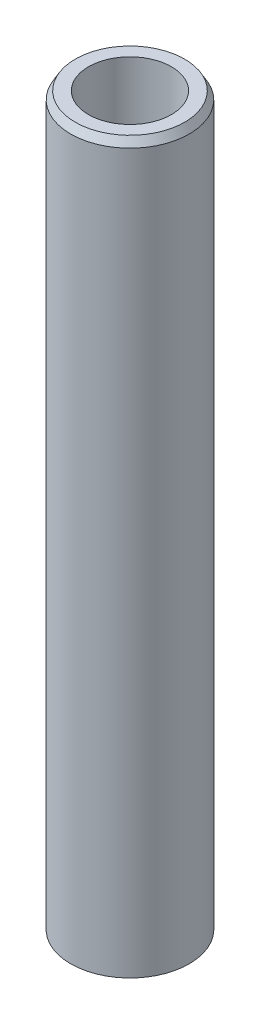
ISO-10303-21;
HEADER;
FILE_DESCRIPTION(('STEP AP214'),'2;1');
FILE_NAME('part.step','',(''),(''),'','','');
FILE_SCHEMA(('AUTOMOTIVE_DESIGN { 1 0 10303 214 1 1 1 1 }'));
ENDSEC;
DATA;
#1=APPLICATION_CONTEXT('core data for automotive mechanical design processes');
#2=APPLICATION_PROTOCOL_DEFINITION('international standard','automotive_design',2000,#1);
#3=PRODUCT_CONTEXT('',#1,'mechanical');
#4=PRODUCT('Part','Part','',(#3));
#5=PRODUCT_RELATED_PRODUCT_CATEGORY('part','',(#4));
#6=PRODUCT_DEFINITION_FORMATION('','',#4);
#7=PRODUCT_DEFINITION_CONTEXT('part definition',#1,'design');
#8=PRODUCT_DEFINITION('design','',#6,#7);
#9=PRODUCT_DEFINITION_SHAPE('','',#8);
#10=(LENGTH_UNIT() NAMED_UNIT(*) SI_UNIT(.MILLI.,.METRE.));
#11=(NAMED_UNIT(*) PLANE_ANGLE_UNIT() SI_UNIT($,.RADIAN.));
#12=(NAMED_UNIT(*) SI_UNIT($,.STERADIAN.) SOLID_ANGLE_UNIT());
#13=UNCERTAINTY_MEASURE_WITH_UNIT(LENGTH_MEASURE(1.E-05),#10,'distance_accuracy_value','');
#14=(GEOMETRIC_REPRESENTATION_CONTEXT(3) GLOBAL_UNCERTAINTY_ASSIGNED_CONTEXT((#13)) GLOBAL_UNIT_ASSIGNED_CONTEXT((#10,
#11,#12)) REPRESENTATION_CONTEXT('',''));
#15=CARTESIAN_POINT('',(0.,0.,0.));
#16=DIRECTION('',(0.,0.,1.));
#17=DIRECTION('',(1.,0.,0.));
#18=AXIS2_PLACEMENT_3D('',#15,#16,#17);
#19=CARTESIAN_POINT('',(0.,462.536337045634,0.));
#20=DIRECTION('',(0.,-1.,0.));
#21=DIRECTION('',(0.,0.,-1.));
#22=AXIS2_PLACEMENT_3D('',#19,#20,#21);
#23=CYLINDRICAL_SURFACE('',#22,37.5);
#24=CARTESIAN_POINT('',(0.,457.516317716799,0.));
#25=DIRECTION('',(0.,1.,0.));
#26=DIRECTION('',(0.,0.,1.));
#27=AXIS2_PLACEMENT_3D('',#24,#25,#26);
#28=CIRCLE('',#27,37.5);
#29=CARTESIAN_POINT('',(0.,457.516317716799,37.5));
#30=VERTEX_POINT('',#29);
#31=EDGE_CURVE('E50',#30,#30,#28,.F.);
#32=ORIENTED_EDGE('',*,*,#31,.T.);
#33=EDGE_LOOP('',(#32));
#34=FACE_BOUND('',#33,.T.);
#35=CARTESIAN_POINT('',(0.,2.89830951084002,0.));
#36=DIRECTION('',(0.,1.,0.));
#37=DIRECTION('',(0.,0.,1.));
#38=AXIS2_PLACEMENT_3D('',#35,#36,#37);
#39=CIRCLE('',#38,37.5);
#40=CARTESIAN_POINT('',(0.,2.89830951084002,37.5));
#41=VERTEX_POINT('',#40);
#42=EDGE_CURVE('E51',#41,#41,#39,.T.);
#43=ORIENTED_EDGE('',*,*,#42,.T.);
#44=EDGE_LOOP('',(#43));
#45=FACE_BOUND('',#44,.T.);
#46=ADVANCED_FACE('F39',(#34,#45),#23,.T.);
#47=CARTESIAN_POINT('',(0.,462.536337045634,0.));
#48=DIRECTION('',(0.,1.,0.));
#49=DIRECTION('',(0.,0.,1.));
#50=AXIS2_PLACEMENT_3D('',#47,#48,#49);
#51=PLANE('',#50);
#52=CARTESIAN_POINT('',(0.,462.536337045634,0.));
#53=DIRECTION('',(0.,1.,0.));
#54=DIRECTION('',(0.,0.,1.));
#55=AXIS2_PLACEMENT_3D('',#52,#53,#54);
#56=CIRCLE('',#55,34.60169048916);
#57=CARTESIAN_POINT('',(0.,462.536337045634,34.60169048916));
#58=VERTEX_POINT('',#57);
#59=EDGE_CURVE('E54',#58,#58,#56,.T.);
#60=ORIENTED_EDGE('',*,*,#59,.T.);
#61=EDGE_LOOP('',(#60));
#62=FACE_BOUND('',#61,.T.);
#63=CARTESIAN_POINT('',(0.,462.536337045634,0.));
#64=DIRECTION('',(0.,1.,0.));
#65=DIRECTION('',(0.,0.,1.));
#66=AXIS2_PLACEMENT_3D('',#63,#64,#65);
#67=CIRCLE('',#66,26.243504614195);
#68=CARTESIAN_POINT('',(0.,462.536337045634,26.243504614195));
#69=VERTEX_POINT('',#68);
#70=EDGE_CURVE('E58',#69,#69,#67,.T.);
#71=ORIENTED_EDGE('',*,*,#70,.F.);
#72=EDGE_LOOP('',(#71));
#73=FACE_BOUND('',#72,.T.);
#74=ADVANCED_FACE('F69',(#62,#73),#51,.T.);
#75=CARTESIAN_POINT('',(0.,0.,0.));
#76=DIRECTION('',(0.,1.,0.));
#77=DIRECTION('',(0.,0.,1.));
#78=AXIS2_PLACEMENT_3D('',#75,#76,#77);
#79=PLANE('',#78);
#80=CARTESIAN_POINT('',(0.,0.,0.));
#81=DIRECTION('',(0.,1.,0.));
#82=DIRECTION('',(0.,0.,1.));
#83=AXIS2_PLACEMENT_3D('',#80,#81,#82);
#84=CIRCLE('',#83,32.4799806711649);
#85=CARTESIAN_POINT('',(0.,0.,32.4799806711649));
#86=VERTEX_POINT('',#85);
#87=EDGE_CURVE('E10',#86,#86,#84,.F.);
#88=ORIENTED_EDGE('',*,*,#87,.T.);
#89=EDGE_LOOP('',(#88));
#90=FACE_BOUND('',#89,.T.);
#91=CARTESIAN_POINT('',(0.,0.,0.));
#92=DIRECTION('',(0.,1.,0.));
#93=DIRECTION('',(0.,0.,1.));
#94=AXIS2_PLACEMENT_3D('',#91,#92,#93);
#95=CIRCLE('',#94,26.243504614195);
#96=CARTESIAN_POINT('',(0.,0.,26.243504614195));
#97=VERTEX_POINT('',#96);
#98=EDGE_CURVE('E63',#97,#97,#95,.T.);
#99=ORIENTED_EDGE('',*,*,#98,.T.);
#100=EDGE_LOOP('',(#99));
#101=FACE_BOUND('',#100,.T.);
#102=ADVANCED_FACE('F75',(#90,#101),#79,.F.);
#103=CARTESIAN_POINT('',(0.,462.536337045634,0.));
#104=DIRECTION('',(0.,-1.,0.));
#105=DIRECTION('',(0.,0.,-1.));
#106=AXIS2_PLACEMENT_3D('',#103,#104,#105);
#107=CYLINDRICAL_SURFACE('',#106,26.243504614195);
#108=ORIENTED_EDGE('',*,*,#70,.T.);
#109=EDGE_LOOP('',(#108));
#110=FACE_BOUND('',#109,.T.);
#111=ORIENTED_EDGE('',*,*,#98,.F.);
#112=EDGE_LOOP('',(#111));
#113=FACE_BOUND('',#112,.T.);
#114=ADVANCED_FACE('F70',(#110,#113),#107,.F.);
#115=CARTESIAN_POINT('',(0.,462.536337045634,0.));
#116=DIRECTION('',(0.,-1.,0.));
#117=DIRECTION('',(0.,0.,-1.));
#118=AXIS2_PLACEMENT_3D('',#115,#116,#117);
#119=CONICAL_SURFACE('',#118,34.60169048916,0.523598775598287);
#120=ORIENTED_EDGE('',*,*,#31,.F.);
#121=EDGE_LOOP('',(#120));
#122=FACE_BOUND('',#121,.T.);
#123=ORIENTED_EDGE('',*,*,#59,.F.);
#124=EDGE_LOOP('',(#123));
#125=FACE_BOUND('',#124,.T.);
#126=ADVANCED_FACE('F81',(#122,#125),#119,.T.);
#127=CARTESIAN_POINT('',(0.,2.89830951084002,0.));
#128=DIRECTION('',(0.,1.,0.));
#129=DIRECTION('',(0.,0.,1.));
#130=AXIS2_PLACEMENT_3D('',#127,#128,#129);
#131=CONICAL_SURFACE('',#130,37.5,1.04719755119661);
#132=CARTESIAN_POINT('',(0.,0.,32.4799806711649));
#133=CARTESIAN_POINT('',(0.,0.0301907240712505,32.5322725391736));
#134=CARTESIAN_POINT('',(0.,0.0603814481425007,32.5845644071823));
#135=CARTESIAN_POINT('',(0.,0.120762896285001,32.6891481431997));
#136=CARTESIAN_POINT('',(0.,0.150953620356251,32.7414400112084));
#137=CARTESIAN_POINT('',(0.,0.211335068498751,32.8460237472258));
#138=CARTESIAN_POINT('',(0.,0.241525792570001,32.8983156152345));
#139=CARTESIAN_POINT('',(0.,0.301907240712502,33.0028993512519));
#140=CARTESIAN_POINT('',(0.,0.332097964783753,33.0551912192606));
#141=CARTESIAN_POINT('',(0.,0.392479412926254,33.159774955278));
#142=CARTESIAN_POINT('',(0.,0.422670136997503,33.2120668232867));
#143=CARTESIAN_POINT('',(0.,0.483051585140003,33.3166505593041));
#144=CARTESIAN_POINT('',(0.,0.513242309211253,33.3689424273128));
#145=CARTESIAN_POINT('',(0.,0.573623757353754,33.4735261633301));
#146=CARTESIAN_POINT('',(0.,0.603814481425005,33.5258180313389));
#147=CARTESIAN_POINT('',(0.,0.664195929567506,33.6304017673563));
#148=CARTESIAN_POINT('',(0.,0.694386653638755,33.6826936353649));
#149=CARTESIAN_POINT('',(0.,0.754768101781255,33.7872773713823));
#150=CARTESIAN_POINT('',(0.,0.784958825852507,33.839569239391));
#151=CARTESIAN_POINT('',(0.,0.845340273995008,33.9441529754084));
#152=CARTESIAN_POINT('',(0.,0.875530998066257,33.9964448434171));
#153=CARTESIAN_POINT('',(0.,0.935912446208757,34.1010285794345));
#154=CARTESIAN_POINT('',(0.,0.966103170280007,34.1533204474432));
#155=CARTESIAN_POINT('',(0.,1.02648461842251,34.2579041834606));
#156=CARTESIAN_POINT('',(0.,1.05667534249376,34.3101960514693));
#157=CARTESIAN_POINT('',(0.,1.11705679063626,34.4147797874867));
#158=CARTESIAN_POINT('',(0.,1.14724751470751,34.4670716554954));
#159=CARTESIAN_POINT('',(0.,1.20762896285001,34.5716553915128));
#160=CARTESIAN_POINT('',(0.,1.23781968692126,34.6239472595215));
#161=CARTESIAN_POINT('',(0.,1.29820113506376,34.7285309955389));
#162=CARTESIAN_POINT('',(0.,1.32839185913501,34.7808228635476));
#163=CARTESIAN_POINT('',(0.,1.38877330727751,34.885406599565));
#164=CARTESIAN_POINT('',(0.,1.41896403134876,34.9376984675737));
#165=CARTESIAN_POINT('',(0.,1.47934547949126,35.0422822035911));
#166=CARTESIAN_POINT('',(0.,1.50953620356251,35.0945740715998));
#167=CARTESIAN_POINT('',(0.,1.56991765170501,35.1991578076172));
#168=CARTESIAN_POINT('',(0.,1.60010837577626,35.2514496756259));
#169=CARTESIAN_POINT('',(0.,1.66048982391876,35.3560334116433));
#170=CARTESIAN_POINT('',(0.,1.69068054799001,35.408325279652));
#171=CARTESIAN_POINT('',(0.,1.75106199613251,35.5129090156694));
#172=CARTESIAN_POINT('',(0.,1.78125272020377,35.5652008836781));
#173=CARTESIAN_POINT('',(0.,1.84163416834627,35.6697846196955));
#174=CARTESIAN_POINT('',(0.,1.87182489241752,35.7220764877042));
#175=CARTESIAN_POINT('',(0.,1.93220634056002,35.8266602237216));
#176=CARTESIAN_POINT('',(0.,1.96239706463127,35.8789520917303));
#177=CARTESIAN_POINT('',(0.,2.02277851277377,35.9835358277477));
#178=CARTESIAN_POINT('',(0.,2.05296923684502,36.0358276957564));
#179=CARTESIAN_POINT('',(0.,2.11335068498752,36.1404114317738));
#180=CARTESIAN_POINT('',(0.,2.14354140905877,36.1927032997825));
#181=CARTESIAN_POINT('',(0.,2.20392285720127,36.2972870357999));
#182=CARTESIAN_POINT('',(0.,2.23411358127252,36.3495789038086));
#183=CARTESIAN_POINT('',(0.,2.29449502941502,36.454162639826));
#184=CARTESIAN_POINT('',(0.,2.32468575348627,36.5064545078347));
#185=CARTESIAN_POINT('',(0.,2.38506720162877,36.6110382438521));
#186=CARTESIAN_POINT('',(0.,2.41525792570002,36.6633301118608));
#187=CARTESIAN_POINT('',(0.,2.47563937384252,36.7679138478782));
#188=CARTESIAN_POINT('',(0.,2.50583009791377,36.8202057158869));
#189=CARTESIAN_POINT('',(0.,2.56621154605627,36.9247894519043));
#190=CARTESIAN_POINT('',(0.,2.59640227012752,36.977081319913));
#191=CARTESIAN_POINT('',(0.,2.65678371827002,37.0816650559304));
#192=CARTESIAN_POINT('',(0.,2.68697444234127,37.1339569239391));
#193=CARTESIAN_POINT('',(0.,2.74735589048377,37.2385406599565));
#194=CARTESIAN_POINT('',(0.,2.77754661455502,37.2908325279652));
#195=CARTESIAN_POINT('',(0.,2.83792806269752,37.3954162639826));
#196=CARTESIAN_POINT('',(0.,2.86811878676878,37.4477081319913));
#197=CARTESIAN_POINT('',(0.,2.89830951084002,37.5));
#198=B_SPLINE_CURVE_WITH_KNOTS('',3,(#132,#133,#134,#135,#136,#137,#138,#139,#140,#141,#142,
#143,#144,#145,#146,#147,#148,#149,#150,#151,#152,#153,#154,#155,#156,#157,#158,#159,#160,#161,
#162,#163,#164,#165,#166,#167,#168,#169,#170,#171,#172,#173,#174,#175,#176,#177,#178,#179,#180,
#181,#182,#183,#184,#185,#186,#187,#188,#189,#190,#191,#192,#193,#194,#195,#196,#197),
.UNSPECIFIED.,.F.,.F.,(4,2,2,2,2,2,2,2,2,2,2,2,2,2,2,2,2,2,2,2,2,2,2,2,2,2,2,2,2,2,2,2,4),(0.,
0.181144344427501,0.362288688855008,0.543433033282515,0.724577377710016,0.905721722137523,
1.08686606656503,1.26801041099253,1.44915475542004,1.63029909984754,1.81144344427505,
1.99258778870255,2.17373213313005,2.35487647755756,2.53602082198507,2.71716516641257,
2.89830951084008,3.07945385526758,3.26059819969508,3.44174254412259,3.62288688855009,
3.8040312329776,3.98517557740511,4.16631992183261,4.34746426626011,4.52860861068762,
4.70975295511512,4.89089729954263,5.07204164397013,5.25318598839764,5.43433033282514,
5.61547467725264,5.79661902168015),.UNSPECIFIED.);
#199=EDGE_CURVE('BSEAM45',#86,#41,#198,.T.);
#200=ORIENTED_EDGE('',*,*,#87,.F.);
#201=ORIENTED_EDGE('',*,*,#42,.F.);
#202=ORIENTED_EDGE('',*,*,#199,.T.);
#203=ORIENTED_EDGE('',*,*,#199,.F.);
#204=EDGE_LOOP('',(#200,#202,#201,#203));
#205=FACE_BOUND('',#204,.T.);
#206=ADVANCED_FACE('F45',(#205),#131,.T.);
#207=CLOSED_SHELL('',(#46,#74,#102,#114,#126,#206));
#208=MANIFOLD_SOLID_BREP('B2',#207);
#209=ADVANCED_BREP_SHAPE_REPRESENTATION('',(#18,#208),#14);
#210=SHAPE_DEFINITION_REPRESENTATION(#9,#209);
ENDSEC;
END-ISO-10303-21;
